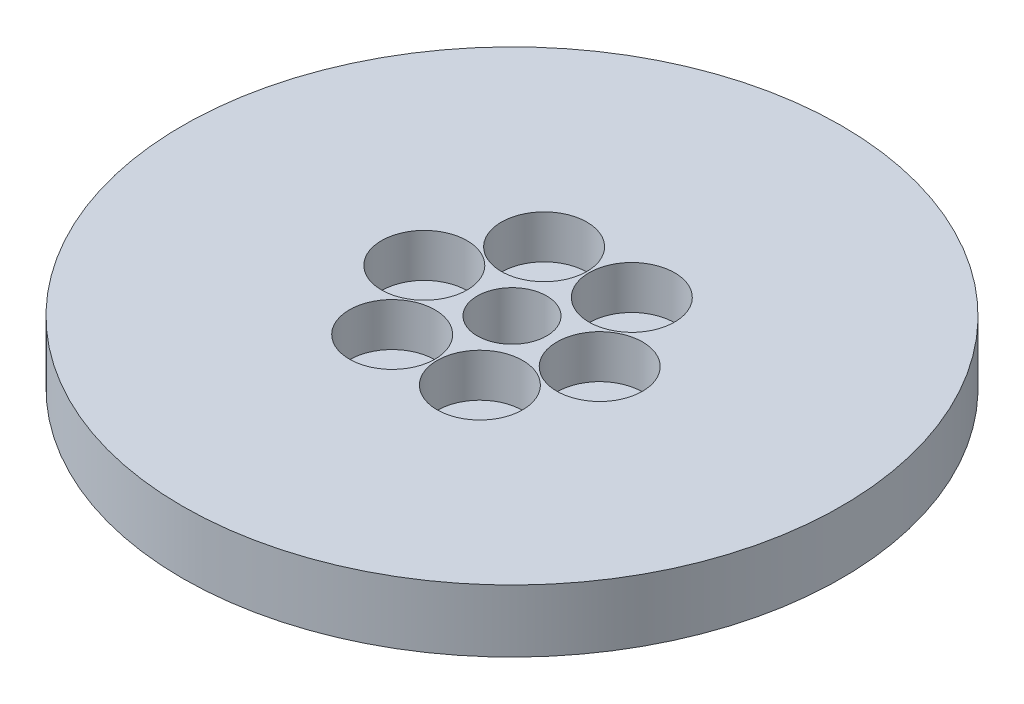
ISO-10303-21;
HEADER;
FILE_DESCRIPTION(('STEP AP214'),'2;1');
FILE_NAME('part.step','',(''),(''),'','','');
FILE_SCHEMA(('AUTOMOTIVE_DESIGN { 1 0 10303 214 1 1 1 1 }'));
ENDSEC;
DATA;
#1=APPLICATION_CONTEXT('core data for automotive mechanical design processes');
#2=APPLICATION_PROTOCOL_DEFINITION('international standard','automotive_design',2000,#1);
#3=PRODUCT_CONTEXT('',#1,'mechanical');
#4=PRODUCT('Part','Part','',(#3));
#5=PRODUCT_RELATED_PRODUCT_CATEGORY('part','',(#4));
#6=PRODUCT_DEFINITION_FORMATION('','',#4);
#7=PRODUCT_DEFINITION_CONTEXT('part definition',#1,'design');
#8=PRODUCT_DEFINITION('design','',#6,#7);
#9=PRODUCT_DEFINITION_SHAPE('','',#8);
#10=(LENGTH_UNIT() NAMED_UNIT(*) SI_UNIT(.MILLI.,.METRE.));
#11=(NAMED_UNIT(*) PLANE_ANGLE_UNIT() SI_UNIT($,.RADIAN.));
#12=(NAMED_UNIT(*) SI_UNIT($,.STERADIAN.) SOLID_ANGLE_UNIT());
#13=UNCERTAINTY_MEASURE_WITH_UNIT(LENGTH_MEASURE(1.E-05),#10,'distance_accuracy_value','');
#14=(GEOMETRIC_REPRESENTATION_CONTEXT(3) GLOBAL_UNCERTAINTY_ASSIGNED_CONTEXT((#13)) GLOBAL_UNIT_ASSIGNED_CONTEXT((#10,
#11,#12)) REPRESENTATION_CONTEXT('',''));
#15=CARTESIAN_POINT('',(0.,0.,0.));
#16=DIRECTION('',(0.,0.,1.));
#17=DIRECTION('',(1.,0.,0.));
#18=AXIS2_PLACEMENT_3D('',#15,#16,#17);
#19=CARTESIAN_POINT('',(0.,9.,0.));
#20=DIRECTION('',(0.,-1.,0.));
#21=DIRECTION('',(0.,0.,-1.));
#22=AXIS2_PLACEMENT_3D('',#19,#20,#21);
#23=CYLINDRICAL_SURFACE('',#22,47.5);
#24=CARTESIAN_POINT('',(0.,9.,0.));
#25=DIRECTION('',(0.,1.,0.));
#26=DIRECTION('',(0.,0.,1.));
#27=AXIS2_PLACEMENT_3D('',#24,#25,#26);
#28=CIRCLE('',#27,47.5);
#29=CARTESIAN_POINT('',(0.,9.,47.5));
#30=VERTEX_POINT('',#29);
#31=EDGE_CURVE('E10',#30,#30,#28,.T.);
#32=ORIENTED_EDGE('',*,*,#31,.F.);
#33=EDGE_LOOP('',(#32));
#34=FACE_BOUND('',#33,.T.);
#35=CARTESIAN_POINT('',(0.,0.,0.));
#36=DIRECTION('',(0.,1.,0.));
#37=DIRECTION('',(0.,0.,1.));
#38=AXIS2_PLACEMENT_3D('',#35,#36,#37);
#39=CIRCLE('',#38,47.5);
#40=CARTESIAN_POINT('',(0.,0.,47.5));
#41=VERTEX_POINT('',#40);
#42=EDGE_CURVE('E37',#41,#41,#39,.T.);
#43=ORIENTED_EDGE('',*,*,#42,.T.);
#44=EDGE_LOOP('',(#43));
#45=FACE_BOUND('',#44,.T.);
#46=ADVANCED_FACE('F40',(#34,#45),#23,.T.);
#47=CARTESIAN_POINT('',(0.,9.,0.));
#48=DIRECTION('',(0.,1.,0.));
#49=DIRECTION('',(0.,0.,1.));
#50=AXIS2_PLACEMENT_3D('',#47,#48,#49);
#51=PLANE('',#50);
#52=CARTESIAN_POINT('',(12.6418976376786,9.,0.));
#53=DIRECTION('',(0.,1.,0.));
#54=DIRECTION('',(0.,0.,-1.));
#55=AXIS2_PLACEMENT_3D('',#52,#53,#54);
#56=CIRCLE('',#55,6.16832687166146);
#57=CARTESIAN_POINT('',(12.6418976376786,9.,-6.16832687166146));
#58=VERTEX_POINT('',#57);
#59=EDGE_CURVE('E71',#58,#58,#56,.T.);
#60=ORIENTED_EDGE('',*,*,#59,.F.);
#61=EDGE_LOOP('',(#60));
#62=FACE_BOUND('',#61,.T.);
#63=CARTESIAN_POINT('',(6.32094881883937,9.,10.9482045062722));
#64=DIRECTION('',(0.,1.,0.));
#65=DIRECTION('',(0.866025403784436,0.,-0.500000000000004));
#66=AXIS2_PLACEMENT_3D('',#63,#64,#65);
#67=CIRCLE('',#66,6.16832687166146);
#68=CARTESIAN_POINT('',(11.6628765885444,9.,7.8640410704414));
#69=VERTEX_POINT('',#68);
#70=EDGE_CURVE('E70',#69,#69,#67,.T.);
#71=ORIENTED_EDGE('',*,*,#70,.F.);
#72=EDGE_LOOP('',(#71));
#73=FACE_BOUND('',#72,.T.);
#74=CARTESIAN_POINT('',(6.32094881883922,9.,-10.9482045062722));
#75=DIRECTION('',(0.,1.,0.));
#76=DIRECTION('',(-0.866025403784443,0.,-0.499999999999992));
#77=AXIS2_PLACEMENT_3D('',#74,#75,#76);
#78=CIRCLE('',#77,6.16832687166146);
#79=CARTESIAN_POINT('',(0.979021049134174,9.,-14.0323679421029));
#80=VERTEX_POINT('',#79);
#81=EDGE_CURVE('E84',#80,#80,#78,.T.);
#82=ORIENTED_EDGE('',*,*,#81,.F.);
#83=EDGE_LOOP('',(#82));
#84=FACE_BOUND('',#83,.T.);
#85=CARTESIAN_POINT('',(-6.32094881883945,9.,-10.9482045062721));
#86=DIRECTION('',(0.,1.,0.));
#87=DIRECTION('',(-0.866025403784433,0.,0.50000000000001));
#88=AXIS2_PLACEMENT_3D('',#85,#86,#87);
#89=CIRCLE('',#88,6.16832687166146);
#90=CARTESIAN_POINT('',(-11.6628765885444,9.,-7.86404107044132));
#91=VERTEX_POINT('',#90);
#92=EDGE_CURVE('E78',#91,#91,#89,.T.);
#93=ORIENTED_EDGE('',*,*,#92,.F.);
#94=EDGE_LOOP('',(#93));
#95=FACE_BOUND('',#94,.T.);
#96=CARTESIAN_POINT('',(-6.32094881883929,9.,10.9482045062722));
#97=DIRECTION('',(0.,1.,0.));
#98=DIRECTION('',(0.86602540378444,0.,0.499999999999998));
#99=AXIS2_PLACEMENT_3D('',#96,#97,#98);
#100=CIRCLE('',#99,6.16832687166146);
#101=CARTESIAN_POINT('',(-0.979021049134272,9.,14.0323679421029));
#102=VERTEX_POINT('',#101);
#103=EDGE_CURVE('E61',#102,#102,#100,.T.);
#104=ORIENTED_EDGE('',*,*,#103,.F.);
#105=EDGE_LOOP('',(#104));
#106=FACE_BOUND('',#105,.T.);
#107=CARTESIAN_POINT('',(-12.6418976376786,9.,0.));
#108=DIRECTION('',(0.,1.,0.));
#109=DIRECTION('',(0.,0.,1.));
#110=AXIS2_PLACEMENT_3D('',#107,#108,#109);
#111=CIRCLE('',#110,6.16832687166146);
#112=CARTESIAN_POINT('',(-12.6418976376786,9.,6.16832687166146));
#113=VERTEX_POINT('',#112);
#114=EDGE_CURVE('E54',#113,#113,#111,.T.);
#115=ORIENTED_EDGE('',*,*,#114,.F.);
#116=EDGE_LOOP('',(#115));
#117=FACE_BOUND('',#116,.T.);
#118=CARTESIAN_POINT('',(0.,9.,0.));
#119=DIRECTION('',(0.,1.,0.));
#120=DIRECTION('',(0.,0.,1.));
#121=AXIS2_PLACEMENT_3D('',#118,#119,#120);
#122=CIRCLE('',#121,5.);
#123=CARTESIAN_POINT('',(0.,9.,5.));
#124=VERTEX_POINT('',#123);
#125=EDGE_CURVE('E50',#124,#124,#122,.T.);
#126=ORIENTED_EDGE('',*,*,#125,.F.);
#127=EDGE_LOOP('',(#126));
#128=FACE_BOUND('',#127,.T.);
#129=ORIENTED_EDGE('',*,*,#31,.T.);
#130=EDGE_LOOP('',(#129));
#131=FACE_BOUND('',#130,.T.);
#132=ADVANCED_FACE('F99',(#62,#73,#84,#95,#106,#117,#128,#131),#51,.T.);
#133=CARTESIAN_POINT('',(0.,0.,0.));
#134=DIRECTION('',(0.,1.,0.));
#135=DIRECTION('',(0.,0.,1.));
#136=AXIS2_PLACEMENT_3D('',#133,#134,#135);
#137=PLANE('',#136);
#138=CARTESIAN_POINT('',(0.,0.,0.));
#139=DIRECTION('',(0.,1.,0.));
#140=DIRECTION('',(0.,0.,1.));
#141=AXIS2_PLACEMENT_3D('',#138,#139,#140);
#142=CIRCLE('',#141,5.);
#143=CARTESIAN_POINT('',(0.,0.,5.));
#144=VERTEX_POINT('',#143);
#145=EDGE_CURVE('E47',#144,#144,#142,.T.);
#146=ORIENTED_EDGE('',*,*,#145,.T.);
#147=EDGE_LOOP('',(#146));
#148=FACE_BOUND('',#147,.T.);
#149=ORIENTED_EDGE('',*,*,#42,.F.);
#150=EDGE_LOOP('',(#149));
#151=FACE_BOUND('',#150,.T.);
#152=ADVANCED_FACE('F103',(#148,#151),#137,.F.);
#153=CARTESIAN_POINT('',(0.,9.,0.));
#154=DIRECTION('',(0.,-1.,0.));
#155=DIRECTION('',(0.,0.,-1.));
#156=AXIS2_PLACEMENT_3D('',#153,#154,#155);
#157=CYLINDRICAL_SURFACE('',#156,5.);
#158=ORIENTED_EDGE('',*,*,#125,.T.);
#159=EDGE_LOOP('',(#158));
#160=FACE_BOUND('',#159,.T.);
#161=ORIENTED_EDGE('',*,*,#145,.F.);
#162=EDGE_LOOP('',(#161));
#163=FACE_BOUND('',#162,.T.);
#164=ADVANCED_FACE('F111',(#160,#163),#157,.F.);
#165=CARTESIAN_POINT('',(-12.6418976376786,2.75852590959451,0.));
#166=DIRECTION('',(0.,1.,0.));
#167=DIRECTION('',(0.,0.,1.));
#168=AXIS2_PLACEMENT_3D('',#165,#166,#167);
#169=CYLINDRICAL_SURFACE('',#168,6.16832687166146);
#170=CARTESIAN_POINT('',(-12.6418976376786,2.75852590959451,0.));
#171=DIRECTION('',(0.,1.,0.));
#172=DIRECTION('',(0.,0.,1.));
#173=AXIS2_PLACEMENT_3D('',#170,#171,#172);
#174=CIRCLE('',#173,6.16832687166146);
#175=CARTESIAN_POINT('',(-12.6418976376786,2.75852590959451,6.16832687166146));
#176=VERTEX_POINT('',#175);
#177=EDGE_CURVE('E55',#176,#176,#174,.T.);
#178=ORIENTED_EDGE('',*,*,#177,.F.);
#179=EDGE_LOOP('',(#178));
#180=FACE_BOUND('',#179,.T.);
#181=ORIENTED_EDGE('',*,*,#114,.T.);
#182=EDGE_LOOP('',(#181));
#183=FACE_BOUND('',#182,.T.);
#184=ADVANCED_FACE('F120',(#180,#183),#169,.F.);
#185=CARTESIAN_POINT('',(-12.6418976376786,2.75852590959451,0.));
#186=DIRECTION('',(0.,1.,0.));
#187=DIRECTION('',(0.,0.,1.));
#188=AXIS2_PLACEMENT_3D('',#185,#186,#187);
#189=PLANE('',#188);
#190=ORIENTED_EDGE('',*,*,#177,.T.);
#191=EDGE_LOOP('',(#190));
#192=FACE_BOUND('',#191,.T.);
#193=ADVANCED_FACE('F150',(#192),#189,.T.);
#194=CARTESIAN_POINT('',(-6.32094881883929,2.75852590959451,10.9482045062722));
#195=DIRECTION('',(0.,1.,0.));
#196=DIRECTION('',(0.,0.,1.));
#197=AXIS2_PLACEMENT_3D('',#194,#195,#196);
#198=CYLINDRICAL_SURFACE('',#197,6.16832687166146);
#199=CARTESIAN_POINT('',(-6.32094881883929,2.75852590959451,10.9482045062722));
#200=DIRECTION('',(0.,1.,0.));
#201=DIRECTION('',(0.86602540378444,0.,0.499999999999998));
#202=AXIS2_PLACEMENT_3D('',#199,#200,#201);
#203=CIRCLE('',#202,6.16832687166146);
#204=CARTESIAN_POINT('',(-0.979021049134272,2.75852590959451,14.0323679421029));
#205=VERTEX_POINT('',#204);
#206=EDGE_CURVE('E59',#205,#205,#203,.T.);
#207=ORIENTED_EDGE('',*,*,#206,.F.);
#208=EDGE_LOOP('',(#207));
#209=FACE_BOUND('',#208,.T.);
#210=ORIENTED_EDGE('',*,*,#103,.T.);
#211=EDGE_LOOP('',(#210));
#212=FACE_BOUND('',#211,.T.);
#213=ADVANCED_FACE('F154',(#209,#212),#198,.F.);
#214=CARTESIAN_POINT('',(-6.32094881883929,2.75852590959451,10.9482045062722));
#215=DIRECTION('',(0.,1.,0.));
#216=DIRECTION('',(0.86602540378444,0.,0.499999999999998));
#217=AXIS2_PLACEMENT_3D('',#214,#215,#216);
#218=PLANE('',#217);
#219=ORIENTED_EDGE('',*,*,#206,.T.);
#220=EDGE_LOOP('',(#219));
#221=FACE_BOUND('',#220,.T.);
#222=ADVANCED_FACE('F166',(#221),#218,.T.);
#223=CARTESIAN_POINT('',(-6.32094881883945,2.75852590959451,-10.9482045062721));
#224=DIRECTION('',(0.,1.,0.));
#225=DIRECTION('',(0.,0.,1.));
#226=AXIS2_PLACEMENT_3D('',#223,#224,#225);
#227=CYLINDRICAL_SURFACE('',#226,6.16832687166146);
#228=CARTESIAN_POINT('',(-6.32094881883945,2.75852590959451,-10.9482045062721));
#229=DIRECTION('',(0.,1.,0.));
#230=DIRECTION('',(-0.866025403784433,0.,0.50000000000001));
#231=AXIS2_PLACEMENT_3D('',#228,#229,#230);
#232=CIRCLE('',#231,6.16832687166146);
#233=CARTESIAN_POINT('',(-11.6628765885444,2.75852590959451,-7.86404107044132));
#234=VERTEX_POINT('',#233);
#235=EDGE_CURVE('E85',#234,#234,#232,.T.);
#236=ORIENTED_EDGE('',*,*,#235,.F.);
#237=EDGE_LOOP('',(#236));
#238=FACE_BOUND('',#237,.T.);
#239=ORIENTED_EDGE('',*,*,#92,.T.);
#240=EDGE_LOOP('',(#239));
#241=FACE_BOUND('',#240,.T.);
#242=ADVANCED_FACE('F177',(#238,#241),#227,.F.);
#243=CARTESIAN_POINT('',(-6.32094881883945,2.75852590959451,-10.9482045062721));
#244=DIRECTION('',(0.,1.,0.));
#245=DIRECTION('',(-0.866025403784433,0.,0.50000000000001));
#246=AXIS2_PLACEMENT_3D('',#243,#244,#245);
#247=PLANE('',#246);
#248=ORIENTED_EDGE('',*,*,#235,.T.);
#249=EDGE_LOOP('',(#248));
#250=FACE_BOUND('',#249,.T.);
#251=ADVANCED_FACE('F96',(#250),#247,.T.);
#252=CARTESIAN_POINT('',(6.32094881883922,2.75852590959451,-10.9482045062722));
#253=DIRECTION('',(0.,1.,0.));
#254=DIRECTION('',(0.,0.,1.));
#255=AXIS2_PLACEMENT_3D('',#252,#253,#254);
#256=CYLINDRICAL_SURFACE('',#255,6.16832687166146);
#257=CARTESIAN_POINT('',(6.32094881883922,2.75852590959451,-10.9482045062722));
#258=DIRECTION('',(0.,1.,0.));
#259=DIRECTION('',(-0.866025403784443,0.,-0.499999999999992));
#260=AXIS2_PLACEMENT_3D('',#257,#258,#259);
#261=CIRCLE('',#260,6.16832687166146);
#262=CARTESIAN_POINT('',(0.979021049134174,2.75852590959451,-14.0323679421029));
#263=VERTEX_POINT('',#262);
#264=EDGE_CURVE('E76',#263,#263,#261,.T.);
#265=ORIENTED_EDGE('',*,*,#264,.F.);
#266=EDGE_LOOP('',(#265));
#267=FACE_BOUND('',#266,.T.);
#268=ORIENTED_EDGE('',*,*,#81,.T.);
#269=EDGE_LOOP('',(#268));
#270=FACE_BOUND('',#269,.T.);
#271=ADVANCED_FACE('F91',(#267,#270),#256,.F.);
#272=CARTESIAN_POINT('',(6.32094881883922,2.75852590959451,-10.9482045062722));
#273=DIRECTION('',(0.,1.,0.));
#274=DIRECTION('',(-0.866025403784443,0.,-0.499999999999992));
#275=AXIS2_PLACEMENT_3D('',#272,#273,#274);
#276=PLANE('',#275);
#277=ORIENTED_EDGE('',*,*,#264,.T.);
#278=EDGE_LOOP('',(#277));
#279=FACE_BOUND('',#278,.T.);
#280=ADVANCED_FACE('F93',(#279),#276,.T.);
#281=CARTESIAN_POINT('',(6.32094881883937,2.75852590959451,10.9482045062722));
#282=DIRECTION('',(0.,1.,0.));
#283=DIRECTION('',(0.,0.,1.));
#284=AXIS2_PLACEMENT_3D('',#281,#282,#283);
#285=CYLINDRICAL_SURFACE('',#284,6.16832687166146);
#286=CARTESIAN_POINT('',(6.32094881883937,2.75852590959451,10.9482045062722));
#287=DIRECTION('',(0.,1.,0.));
#288=DIRECTION('',(0.866025403784436,0.,-0.500000000000004));
#289=AXIS2_PLACEMENT_3D('',#286,#287,#288);
#290=CIRCLE('',#289,6.16832687166146);
#291=CARTESIAN_POINT('',(11.6628765885444,2.75852590959451,7.8640410704414));
#292=VERTEX_POINT('',#291);
#293=EDGE_CURVE('E63',#292,#292,#290,.T.);
#294=ORIENTED_EDGE('',*,*,#293,.F.);
#295=EDGE_LOOP('',(#294));
#296=FACE_BOUND('',#295,.T.);
#297=ORIENTED_EDGE('',*,*,#70,.T.);
#298=EDGE_LOOP('',(#297));
#299=FACE_BOUND('',#298,.T.);
#300=ADVANCED_FACE('F208',(#296,#299),#285,.F.);
#301=CARTESIAN_POINT('',(6.32094881883937,2.75852590959451,10.9482045062722));
#302=DIRECTION('',(0.,1.,0.));
#303=DIRECTION('',(0.866025403784436,0.,-0.500000000000004));
#304=AXIS2_PLACEMENT_3D('',#301,#302,#303);
#305=PLANE('',#304);
#306=ORIENTED_EDGE('',*,*,#293,.T.);
#307=EDGE_LOOP('',(#306));
#308=FACE_BOUND('',#307,.T.);
#309=ADVANCED_FACE('F216',(#308),#305,.T.);
#310=CARTESIAN_POINT('',(12.6418976376786,2.75852590959451,0.));
#311=DIRECTION('',(0.,1.,0.));
#312=DIRECTION('',(0.,0.,1.));
#313=AXIS2_PLACEMENT_3D('',#310,#311,#312);
#314=CYLINDRICAL_SURFACE('',#313,6.16832687166146);
#315=CARTESIAN_POINT('',(12.6418976376786,2.75852590959451,0.));
#316=DIRECTION('',(0.,1.,0.));
#317=DIRECTION('',(0.,0.,-1.));
#318=AXIS2_PLACEMENT_3D('',#315,#316,#317);
#319=CIRCLE('',#318,6.16832687166146);
#320=CARTESIAN_POINT('',(12.6418976376786,2.75852590959451,-6.16832687166146));
#321=VERTEX_POINT('',#320);
#322=EDGE_CURVE('E69',#321,#321,#319,.T.);
#323=ORIENTED_EDGE('',*,*,#322,.F.);
#324=EDGE_LOOP('',(#323));
#325=FACE_BOUND('',#324,.T.);
#326=ORIENTED_EDGE('',*,*,#59,.T.);
#327=EDGE_LOOP('',(#326));
#328=FACE_BOUND('',#327,.T.);
#329=ADVANCED_FACE('F223',(#325,#328),#314,.F.);
#330=CARTESIAN_POINT('',(12.6418976376786,2.75852590959451,0.));
#331=DIRECTION('',(0.,1.,0.));
#332=DIRECTION('',(0.,0.,-1.));
#333=AXIS2_PLACEMENT_3D('',#330,#331,#332);
#334=PLANE('',#333);
#335=ORIENTED_EDGE('',*,*,#322,.T.);
#336=EDGE_LOOP('',(#335));
#337=FACE_BOUND('',#336,.T.);
#338=ADVANCED_FACE('F233',(#337),#334,.T.);
#339=CLOSED_SHELL('',(#46,#132,#152,#164,#184,#193,#213,#222,#242,#251,#271,#280,#300,#309,#329,#338));
#340=MANIFOLD_SOLID_BREP('B2',#339);
#341=ADVANCED_BREP_SHAPE_REPRESENTATION('',(#18,#340),#14);
#342=SHAPE_DEFINITION_REPRESENTATION(#9,#341);
ENDSEC;
END-ISO-10303-21;
